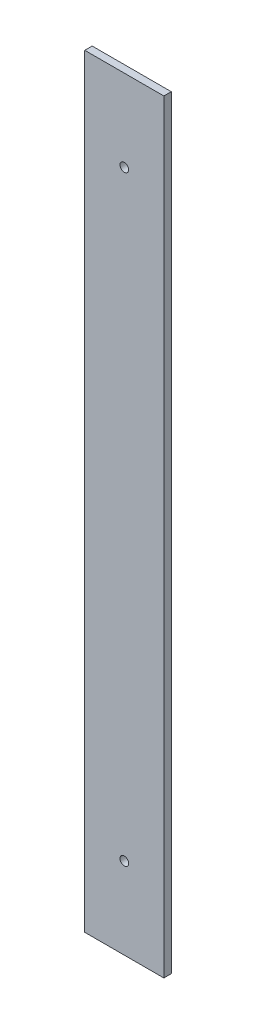
ISO-10303-21;
HEADER;
FILE_DESCRIPTION(('STEP AP214'),'2;1');
FILE_NAME('part.step','',(''),(''),'','','');
FILE_SCHEMA(('AUTOMOTIVE_DESIGN { 1 0 10303 214 1 1 1 1 }'));
ENDSEC;
DATA;
#1=APPLICATION_CONTEXT('core data for automotive mechanical design processes');
#2=APPLICATION_PROTOCOL_DEFINITION('international standard','automotive_design',2000,#1);
#3=PRODUCT_CONTEXT('',#1,'mechanical');
#4=PRODUCT('Part','Part','',(#3));
#5=PRODUCT_RELATED_PRODUCT_CATEGORY('part','',(#4));
#6=PRODUCT_DEFINITION_FORMATION('','',#4);
#7=PRODUCT_DEFINITION_CONTEXT('part definition',#1,'design');
#8=PRODUCT_DEFINITION('design','',#6,#7);
#9=PRODUCT_DEFINITION_SHAPE('','',#8);
#10=(LENGTH_UNIT() NAMED_UNIT(*) SI_UNIT(.MILLI.,.METRE.));
#11=(NAMED_UNIT(*) PLANE_ANGLE_UNIT() SI_UNIT($,.RADIAN.));
#12=(NAMED_UNIT(*) SI_UNIT($,.STERADIAN.) SOLID_ANGLE_UNIT());
#13=UNCERTAINTY_MEASURE_WITH_UNIT(LENGTH_MEASURE(1.E-05),#10,'distance_accuracy_value','');
#14=(GEOMETRIC_REPRESENTATION_CONTEXT(3) GLOBAL_UNCERTAINTY_ASSIGNED_CONTEXT((#13)) GLOBAL_UNIT_ASSIGNED_CONTEXT((#10,
#11,#12)) REPRESENTATION_CONTEXT('',''));
#15=CARTESIAN_POINT('',(0.,0.,0.));
#16=DIRECTION('',(0.,0.,1.));
#17=DIRECTION('',(1.,0.,0.));
#18=AXIS2_PLACEMENT_3D('',#15,#16,#17);
#19=CARTESIAN_POINT('',(0.,0.,3.));
#20=DIRECTION('',(0.,0.,-1.));
#21=DIRECTION('',(-1.,0.,0.));
#22=AXIS2_PLACEMENT_3D('',#19,#20,#21);
#23=PLANE('',#22);
#24=DIRECTION('',(0.,-1.,0.));
#25=VECTOR('',#24,1.);
#26=CARTESIAN_POINT('',(-16.,154.5,3.));
#27=LINE('',#26,#25);
#28=CARTESIAN_POINT('',(-16.,154.5,3.));
#29=VERTEX_POINT('',#28);
#30=CARTESIAN_POINT('',(-16.,-154.5,3.));
#31=VERTEX_POINT('',#30);
#32=EDGE_CURVE('E91',#29,#31,#27,.T.);
#33=ORIENTED_EDGE('',*,*,#32,.T.);
#34=DIRECTION('',(1.,0.,0.));
#35=VECTOR('',#34,1.);
#36=CARTESIAN_POINT('',(16.,-154.5,3.));
#37=LINE('',#36,#35);
#38=CARTESIAN_POINT('',(16.,-154.5,3.));
#39=VERTEX_POINT('',#38);
#40=EDGE_CURVE('E86',#31,#39,#37,.T.);
#41=ORIENTED_EDGE('',*,*,#40,.T.);
#42=DIRECTION('',(0.,1.,0.));
#43=VECTOR('',#42,1.);
#44=CARTESIAN_POINT('',(16.,154.5,3.));
#45=LINE('',#44,#43);
#46=CARTESIAN_POINT('',(16.,154.5,3.));
#47=VERTEX_POINT('',#46);
#48=EDGE_CURVE('E89',#39,#47,#45,.T.);
#49=ORIENTED_EDGE('',*,*,#48,.T.);
#50=DIRECTION('',(-1.,0.,0.));
#51=VECTOR('',#50,1.);
#52=CARTESIAN_POINT('',(16.,154.5,3.));
#53=LINE('',#52,#51);
#54=EDGE_CURVE('E56',#47,#29,#53,.T.);
#55=ORIENTED_EDGE('',*,*,#54,.T.);
#56=EDGE_LOOP('',(#33,#41,#49,#55));
#57=FACE_BOUND('',#56,.T.);
#58=CARTESIAN_POINT('',(0.,121.5,3.));
#59=DIRECTION('',(0.,0.,1.));
#60=DIRECTION('',(1.,0.,0.));
#61=AXIS2_PLACEMENT_3D('',#58,#59,#60);
#62=CIRCLE('',#61,1.75);
#63=CARTESIAN_POINT('',(1.75,121.5,3.));
#64=VERTEX_POINT('',#63);
#65=EDGE_CURVE('E106',#64,#64,#62,.T.);
#66=ORIENTED_EDGE('',*,*,#65,.F.);
#67=EDGE_LOOP('',(#66));
#68=FACE_BOUND('',#67,.T.);
#69=CARTESIAN_POINT('',(0.,-121.5,3.));
#70=DIRECTION('',(0.,0.,1.));
#71=DIRECTION('',(-1.,0.,0.));
#72=AXIS2_PLACEMENT_3D('',#69,#70,#71);
#73=CIRCLE('',#72,1.75);
#74=CARTESIAN_POINT('',(-1.75,-121.5,3.));
#75=VERTEX_POINT('',#74);
#76=EDGE_CURVE('E121',#75,#75,#73,.T.);
#77=ORIENTED_EDGE('',*,*,#76,.F.);
#78=EDGE_LOOP('',(#77));
#79=FACE_BOUND('',#78,.T.);
#80=ADVANCED_FACE('F39',(#57,#68,#79),#23,.F.);
#81=CARTESIAN_POINT('',(0.,0.,0.));
#82=DIRECTION('',(0.,0.,-1.));
#83=DIRECTION('',(-1.,0.,0.));
#84=AXIS2_PLACEMENT_3D('',#81,#82,#83);
#85=PLANE('',#84);
#86=CARTESIAN_POINT('',(0.,121.5,0.));
#87=DIRECTION('',(0.,0.,1.));
#88=DIRECTION('',(1.,0.,0.));
#89=AXIS2_PLACEMENT_3D('',#86,#87,#88);
#90=CIRCLE('',#89,1.75);
#91=CARTESIAN_POINT('',(1.75,121.5,0.));
#92=VERTEX_POINT('',#91);
#93=EDGE_CURVE('E118',#92,#92,#90,.T.);
#94=ORIENTED_EDGE('',*,*,#93,.T.);
#95=EDGE_LOOP('',(#94));
#96=FACE_BOUND('',#95,.T.);
#97=DIRECTION('',(0.,-1.,0.));
#98=VECTOR('',#97,1.);
#99=CARTESIAN_POINT('',(-16.,154.5,0.));
#100=LINE('',#99,#98);
#101=CARTESIAN_POINT('',(-16.,154.5,0.));
#102=VERTEX_POINT('',#101);
#103=CARTESIAN_POINT('',(-16.,-154.5,0.));
#104=VERTEX_POINT('',#103);
#105=EDGE_CURVE('E103',#102,#104,#100,.T.);
#106=ORIENTED_EDGE('',*,*,#105,.F.);
#107=DIRECTION('',(-1.,0.,0.));
#108=VECTOR('',#107,1.);
#109=CARTESIAN_POINT('',(16.,154.5,0.));
#110=LINE('',#109,#108);
#111=CARTESIAN_POINT('',(16.,154.5,0.));
#112=VERTEX_POINT('',#111);
#113=EDGE_CURVE('E79',#112,#102,#110,.T.);
#114=ORIENTED_EDGE('',*,*,#113,.F.);
#115=DIRECTION('',(0.,1.,0.));
#116=VECTOR('',#115,1.);
#117=CARTESIAN_POINT('',(16.,154.5,0.));
#118=LINE('',#117,#116);
#119=CARTESIAN_POINT('',(16.,-154.5,0.));
#120=VERTEX_POINT('',#119);
#121=EDGE_CURVE('E73',#120,#112,#118,.T.);
#122=ORIENTED_EDGE('',*,*,#121,.F.);
#123=DIRECTION('',(1.,0.,0.));
#124=VECTOR('',#123,1.);
#125=CARTESIAN_POINT('',(16.,-154.5,0.));
#126=LINE('',#125,#124);
#127=EDGE_CURVE('E95',#104,#120,#126,.T.);
#128=ORIENTED_EDGE('',*,*,#127,.F.);
#129=EDGE_LOOP('',(#106,#114,#122,#128));
#130=FACE_BOUND('',#129,.T.);
#131=CARTESIAN_POINT('',(0.,-121.5,0.));
#132=DIRECTION('',(0.,0.,1.));
#133=DIRECTION('',(-1.,0.,0.));
#134=AXIS2_PLACEMENT_3D('',#131,#132,#133);
#135=CIRCLE('',#134,1.75);
#136=CARTESIAN_POINT('',(-1.75,-121.5,0.));
#137=VERTEX_POINT('',#136);
#138=EDGE_CURVE('E124',#137,#137,#135,.T.);
#139=ORIENTED_EDGE('',*,*,#138,.T.);
#140=EDGE_LOOP('',(#139));
#141=FACE_BOUND('',#140,.T.);
#142=ADVANCED_FACE('F114',(#96,#130,#141),#85,.T.);
#143=CARTESIAN_POINT('',(-16.,154.5,3.));
#144=DIRECTION('',(1.,0.,0.));
#145=DIRECTION('',(0.,1.,0.));
#146=AXIS2_PLACEMENT_3D('',#143,#144,#145);
#147=PLANE('',#146);
#148=ORIENTED_EDGE('',*,*,#105,.T.);
#149=DIRECTION('',(0.,0.,-1.));
#150=VECTOR('',#149,1.);
#151=CARTESIAN_POINT('',(-16.,-154.5,3.));
#152=LINE('',#151,#150);
#153=EDGE_CURVE('E11',#31,#104,#152,.T.);
#154=ORIENTED_EDGE('',*,*,#153,.F.);
#155=ORIENTED_EDGE('',*,*,#32,.F.);
#156=DIRECTION('',(0.,0.,-1.));
#157=VECTOR('',#156,1.);
#158=CARTESIAN_POINT('',(-16.,154.5,3.));
#159=LINE('',#158,#157);
#160=EDGE_CURVE('E99',#29,#102,#159,.T.);
#161=ORIENTED_EDGE('',*,*,#160,.T.);
#162=EDGE_LOOP('',(#148,#154,#155,#161));
#163=FACE_BOUND('',#162,.T.);
#164=ADVANCED_FACE('F41',(#163),#147,.F.);
#165=CARTESIAN_POINT('',(16.,-154.5,3.));
#166=DIRECTION('',(0.,1.,0.));
#167=DIRECTION('',(0.,0.,1.));
#168=AXIS2_PLACEMENT_3D('',#165,#166,#167);
#169=PLANE('',#168);
#170=ORIENTED_EDGE('',*,*,#127,.T.);
#171=DIRECTION('',(0.,0.,-1.));
#172=VECTOR('',#171,1.);
#173=CARTESIAN_POINT('',(16.,-154.5,3.));
#174=LINE('',#173,#172);
#175=EDGE_CURVE('E48',#39,#120,#174,.T.);
#176=ORIENTED_EDGE('',*,*,#175,.F.);
#177=ORIENTED_EDGE('',*,*,#40,.F.);
#178=ORIENTED_EDGE('',*,*,#153,.T.);
#179=EDGE_LOOP('',(#170,#176,#177,#178));
#180=FACE_BOUND('',#179,.T.);
#181=ADVANCED_FACE('F94',(#180),#169,.F.);
#182=CARTESIAN_POINT('',(16.,154.5,3.));
#183=DIRECTION('',(-1.,0.,0.));
#184=DIRECTION('',(0.,-1.,0.));
#185=AXIS2_PLACEMENT_3D('',#182,#183,#184);
#186=PLANE('',#185);
#187=ORIENTED_EDGE('',*,*,#121,.T.);
#188=DIRECTION('',(0.,0.,-1.));
#189=VECTOR('',#188,1.);
#190=CARTESIAN_POINT('',(16.,154.5,3.));
#191=LINE('',#190,#189);
#192=EDGE_CURVE('E96',#47,#112,#191,.T.);
#193=ORIENTED_EDGE('',*,*,#192,.F.);
#194=ORIENTED_EDGE('',*,*,#48,.F.);
#195=ORIENTED_EDGE('',*,*,#175,.T.);
#196=EDGE_LOOP('',(#187,#193,#194,#195));
#197=FACE_BOUND('',#196,.T.);
#198=ADVANCED_FACE('F97',(#197),#186,.F.);
#199=CARTESIAN_POINT('',(16.,154.5,3.));
#200=DIRECTION('',(0.,-1.,0.));
#201=DIRECTION('',(0.,0.,-1.));
#202=AXIS2_PLACEMENT_3D('',#199,#200,#201);
#203=PLANE('',#202);
#204=ORIENTED_EDGE('',*,*,#113,.T.);
#205=ORIENTED_EDGE('',*,*,#160,.F.);
#206=ORIENTED_EDGE('',*,*,#54,.F.);
#207=ORIENTED_EDGE('',*,*,#192,.T.);
#208=EDGE_LOOP('',(#204,#205,#206,#207));
#209=FACE_BOUND('',#208,.T.);
#210=ADVANCED_FACE('F111',(#209),#203,.F.);
#211=CARTESIAN_POINT('',(0.,121.5,3.));
#212=DIRECTION('',(0.,0.,-1.));
#213=DIRECTION('',(-1.,0.,0.));
#214=AXIS2_PLACEMENT_3D('',#211,#212,#213);
#215=CYLINDRICAL_SURFACE('',#214,1.75);
#216=ORIENTED_EDGE('',*,*,#65,.T.);
#217=EDGE_LOOP('',(#216));
#218=FACE_BOUND('',#217,.T.);
#219=ORIENTED_EDGE('',*,*,#93,.F.);
#220=EDGE_LOOP('',(#219));
#221=FACE_BOUND('',#220,.T.);
#222=ADVANCED_FACE('F141',(#218,#221),#215,.F.);
#223=CARTESIAN_POINT('',(0.,-121.5,3.));
#224=DIRECTION('',(0.,0.,-1.));
#225=DIRECTION('',(-1.,0.,0.));
#226=AXIS2_PLACEMENT_3D('',#223,#224,#225);
#227=CYLINDRICAL_SURFACE('',#226,1.75);
#228=ORIENTED_EDGE('',*,*,#76,.T.);
#229=EDGE_LOOP('',(#228));
#230=FACE_BOUND('',#229,.T.);
#231=ORIENTED_EDGE('',*,*,#138,.F.);
#232=EDGE_LOOP('',(#231));
#233=FACE_BOUND('',#232,.T.);
#234=ADVANCED_FACE('F130',(#230,#233),#227,.F.);
#235=CLOSED_SHELL('',(#80,#142,#164,#181,#198,#210,#222,#234));
#236=MANIFOLD_SOLID_BREP('B2',#235);
#237=ADVANCED_BREP_SHAPE_REPRESENTATION('',(#18,#236),#14);
#238=SHAPE_DEFINITION_REPRESENTATION(#9,#237);
ENDSEC;
END-ISO-10303-21;
